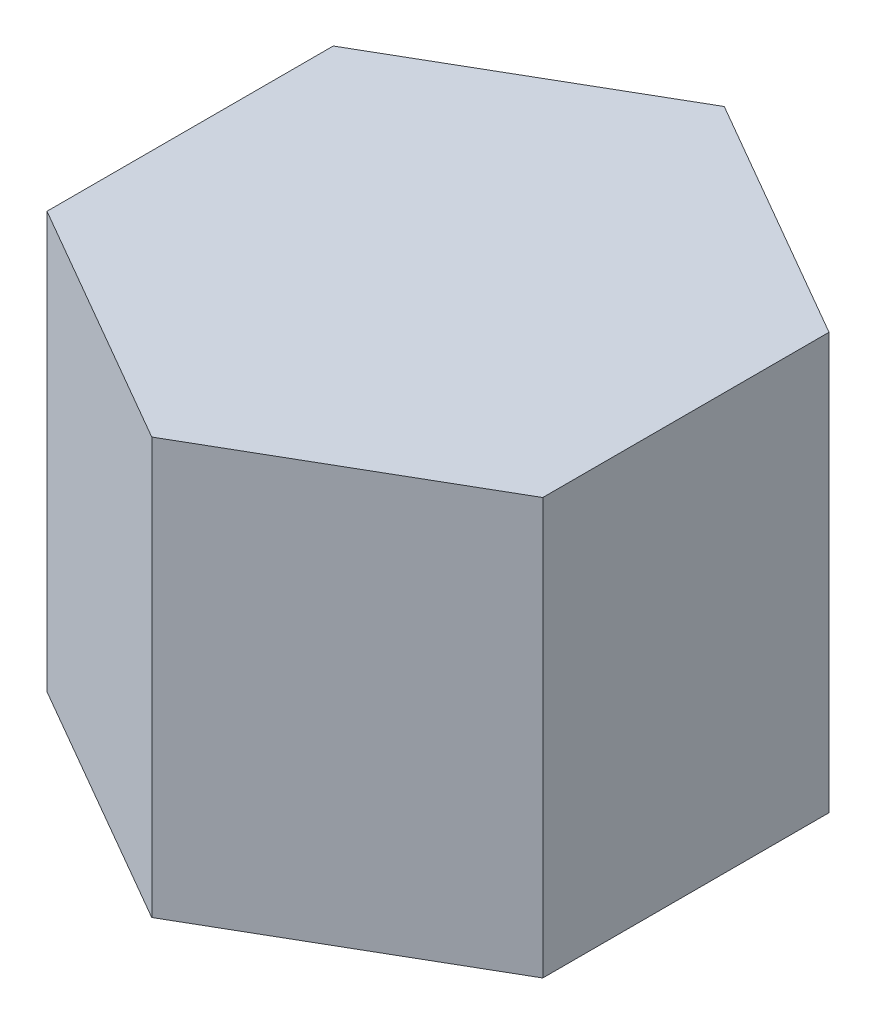
ISO-10303-21;
HEADER;
FILE_DESCRIPTION(('STEP AP214'),'2;1');
FILE_NAME('part.step','',(''),(''),'','','');
FILE_SCHEMA(('AUTOMOTIVE_DESIGN { 1 0 10303 214 1 1 1 1 }'));
ENDSEC;
DATA;
#1=APPLICATION_CONTEXT('core data for automotive mechanical design processes');
#2=APPLICATION_PROTOCOL_DEFINITION('international standard','automotive_design',2000,#1);
#3=PRODUCT_CONTEXT('',#1,'mechanical');
#4=PRODUCT('Part','Part','',(#3));
#5=PRODUCT_RELATED_PRODUCT_CATEGORY('part','',(#4));
#6=PRODUCT_DEFINITION_FORMATION('','',#4);
#7=PRODUCT_DEFINITION_CONTEXT('part definition',#1,'design');
#8=PRODUCT_DEFINITION('design','',#6,#7);
#9=PRODUCT_DEFINITION_SHAPE('','',#8);
#10=(LENGTH_UNIT() NAMED_UNIT(*) SI_UNIT(.MILLI.,.METRE.));
#11=(NAMED_UNIT(*) PLANE_ANGLE_UNIT() SI_UNIT($,.RADIAN.));
#12=(NAMED_UNIT(*) SI_UNIT($,.STERADIAN.) SOLID_ANGLE_UNIT());
#13=UNCERTAINTY_MEASURE_WITH_UNIT(LENGTH_MEASURE(1.E-05),#10,'distance_accuracy_value','');
#14=(GEOMETRIC_REPRESENTATION_CONTEXT(3) GLOBAL_UNCERTAINTY_ASSIGNED_CONTEXT((#13)) GLOBAL_UNIT_ASSIGNED_CONTEXT((#10,
#11,#12)) REPRESENTATION_CONTEXT('',''));
#15=CARTESIAN_POINT('',(0.,0.,0.));
#16=DIRECTION('',(0.,0.,1.));
#17=DIRECTION('',(1.,0.,0.));
#18=AXIS2_PLACEMENT_3D('',#15,#16,#17);
#19=CARTESIAN_POINT('',(203.339551417382,-147.556598747966,288.217869605357));
#20=DIRECTION('',(-0.499999999999943,0.,-0.866025403784471));
#21=DIRECTION('',(-0.866025403784471,0.,0.499999999999943));
#22=AXIS2_PLACEMENT_3D('',#19,#20,#21);
#23=PLANE('',#22);
#24=CARTESIAN_POINT('',(203.642660308706,-147.047793579175,288.042869605357));
#25=DIRECTION('',(-0.866025403784471,0.,0.499999999999943));
#26=VECTOR('',#25,1.);
#27=LINE('',#24,#26);
#28=CARTESIAN_POINT('',(203.642660308706,-147.047793579175,288.042869605357));
#29=VERTEX_POINT('',#28);
#30=CARTESIAN_POINT('',(203.339551417382,-147.047793579175,288.217869605357));
#31=VERTEX_POINT('',#30);
#32=EDGE_CURVE('E170',#29,#31,#27,.T.);
#33=ORIENTED_EDGE('',*,*,#32,.T.);
#34=CARTESIAN_POINT('',(203.339551417382,-147.556598747966,288.217869605357));
#35=DIRECTION('',(0.,1.,0.));
#36=VECTOR('',#35,1.);
#37=LINE('',#34,#36);
#38=CARTESIAN_POINT('',(203.339551417382,-147.556598747966,288.217869605357));
#39=VERTEX_POINT('',#38);
#40=EDGE_CURVE('E35',#39,#31,#37,.T.);
#41=ORIENTED_EDGE('',*,*,#40,.F.);
#42=CARTESIAN_POINT('',(203.642660308706,-147.556598747966,288.042869605357));
#43=DIRECTION('',(-0.866025403784471,0.,0.499999999999943));
#44=VECTOR('',#43,1.);
#45=LINE('',#42,#44);
#46=CARTESIAN_POINT('',(203.642660308706,-147.556598747966,288.042869605357));
#47=VERTEX_POINT('',#46);
#48=EDGE_CURVE('E159',#47,#39,#45,.T.);
#49=ORIENTED_EDGE('',*,*,#48,.F.);
#50=CARTESIAN_POINT('',(203.642660308706,-147.556598747966,288.042869605357));
#51=DIRECTION('',(0.,1.,0.));
#52=VECTOR('',#51,1.);
#53=LINE('',#50,#52);
#54=EDGE_CURVE('E10',#47,#29,#53,.T.);
#55=ORIENTED_EDGE('',*,*,#54,.T.);
#56=EDGE_LOOP('',(#33,#41,#49,#55));
#57=FACE_BOUND('',#56,.T.);
#58=ADVANCED_FACE('F16',(#57),#23,.F.);
#59=CARTESIAN_POINT('',(203.642660308706,-147.556598747966,291.594471220494));
#60=DIRECTION('',(-1.,0.,0.));
#61=DIRECTION('',(0.,-1.,0.));
#62=AXIS2_PLACEMENT_3D('',#59,#60,#61);
#63=PLANE('',#62);
#64=CARTESIAN_POINT('',(203.642660308706,-147.047793579175,287.692869605357));
#65=DIRECTION('',(0.,0.,1.));
#66=VECTOR('',#65,1.);
#67=LINE('',#64,#66);
#68=CARTESIAN_POINT('',(203.642660308706,-147.047793579175,287.692869605357));
#69=VERTEX_POINT('',#68);
#70=EDGE_CURVE('E167',#69,#29,#67,.T.);
#71=ORIENTED_EDGE('',*,*,#70,.T.);
#72=ORIENTED_EDGE('',*,*,#54,.F.);
#73=CARTESIAN_POINT('',(203.642660308706,-147.556598747966,287.692869605357));
#74=DIRECTION('',(0.,0.,1.));
#75=VECTOR('',#74,1.);
#76=LINE('',#73,#75);
#77=CARTESIAN_POINT('',(203.642660308706,-147.556598747966,287.692869605357));
#78=VERTEX_POINT('',#77);
#79=EDGE_CURVE('E156',#78,#47,#76,.T.);
#80=ORIENTED_EDGE('',*,*,#79,.F.);
#81=CARTESIAN_POINT('',(203.642660308706,-147.556598747966,287.692869605357));
#82=DIRECTION('',(0.,1.,0.));
#83=VECTOR('',#82,1.);
#84=LINE('',#81,#83);
#85=EDGE_CURVE('E27',#78,#69,#84,.T.);
#86=ORIENTED_EDGE('',*,*,#85,.T.);
#87=EDGE_LOOP('',(#71,#72,#80,#86));
#88=FACE_BOUND('',#87,.T.);
#89=ADVANCED_FACE('F189',(#88),#63,.F.);
#90=CARTESIAN_POINT('',(203.642660308706,-147.556598747966,287.692869605357));
#91=DIRECTION('',(-0.499999999999978,0.,0.866025403784452));
#92=DIRECTION('',(0.866025403784452,0.,0.499999999999978));
#93=AXIS2_PLACEMENT_3D('',#90,#91,#92);
#94=PLANE('',#93);
#95=CARTESIAN_POINT('',(203.339551417382,-147.047793579175,287.517869605357));
#96=DIRECTION('',(0.866025403784452,0.,0.499999999999978));
#97=VECTOR('',#96,1.);
#98=LINE('',#95,#97);
#99=CARTESIAN_POINT('',(203.339551417382,-147.047793579175,287.517869605357));
#100=VERTEX_POINT('',#99);
#101=EDGE_CURVE('E163',#100,#69,#98,.T.);
#102=ORIENTED_EDGE('',*,*,#101,.T.);
#103=ORIENTED_EDGE('',*,*,#85,.F.);
#104=CARTESIAN_POINT('',(203.339551417382,-147.556598747966,287.517869605357));
#105=DIRECTION('',(0.866025403784452,0.,0.499999999999978));
#106=VECTOR('',#105,1.);
#107=LINE('',#104,#106);
#108=CARTESIAN_POINT('',(203.339551417382,-147.556598747966,287.517869605357));
#109=VERTEX_POINT('',#108);
#110=EDGE_CURVE('E106',#109,#78,#107,.T.);
#111=ORIENTED_EDGE('',*,*,#110,.F.);
#112=CARTESIAN_POINT('',(203.339551417382,-147.556598747966,287.517869605357));
#113=DIRECTION('',(0.,1.,0.));
#114=VECTOR('',#113,1.);
#115=LINE('',#112,#114);
#116=EDGE_CURVE('E94',#109,#100,#115,.T.);
#117=ORIENTED_EDGE('',*,*,#116,.T.);
#118=EDGE_LOOP('',(#102,#103,#111,#117));
#119=FACE_BOUND('',#118,.T.);
#120=ADVANCED_FACE('F198',(#119),#94,.F.);
#121=CARTESIAN_POINT('',(203.339551417382,-147.556598747966,287.517869605357));
#122=DIRECTION('',(0.499999999999978,0.,0.866025403784452));
#123=DIRECTION('',(0.866025403784452,0.,-0.499999999999978));
#124=AXIS2_PLACEMENT_3D('',#121,#122,#123);
#125=PLANE('',#124);
#126=CARTESIAN_POINT('',(203.036442526057,-147.047793579175,287.692869605357));
#127=DIRECTION('',(0.866025403784452,0.,-0.499999999999978));
#128=VECTOR('',#127,1.);
#129=LINE('',#126,#128);
#130=CARTESIAN_POINT('',(203.036442526057,-147.047793579175,287.692869605357));
#131=VERTEX_POINT('',#130);
#132=EDGE_CURVE('E162',#131,#100,#129,.T.);
#133=ORIENTED_EDGE('',*,*,#132,.T.);
#134=ORIENTED_EDGE('',*,*,#116,.F.);
#135=CARTESIAN_POINT('',(203.036442526057,-147.556598747966,287.692869605357));
#136=DIRECTION('',(0.866025403784452,0.,-0.499999999999978));
#137=VECTOR('',#136,1.);
#138=LINE('',#135,#137);
#139=CARTESIAN_POINT('',(203.036442526057,-147.556598747966,287.692869605357));
#140=VERTEX_POINT('',#139);
#141=EDGE_CURVE('E98',#140,#109,#138,.T.);
#142=ORIENTED_EDGE('',*,*,#141,.F.);
#143=CARTESIAN_POINT('',(203.036442526057,-147.556598747966,287.692869605357));
#144=DIRECTION('',(0.,1.,0.));
#145=VECTOR('',#144,1.);
#146=LINE('',#143,#145);
#147=EDGE_CURVE('E79',#140,#131,#146,.T.);
#148=ORIENTED_EDGE('',*,*,#147,.T.);
#149=EDGE_LOOP('',(#133,#134,#142,#148));
#150=FACE_BOUND('',#149,.T.);
#151=ADVANCED_FACE('F100',(#150),#125,.F.);
#152=CARTESIAN_POINT('',(203.036442526057,-147.556598747966,291.594471220494));
#153=DIRECTION('',(1.,0.,0.));
#154=DIRECTION('',(0.,1.,0.));
#155=AXIS2_PLACEMENT_3D('',#152,#153,#154);
#156=PLANE('',#155);
#157=CARTESIAN_POINT('',(203.036442526057,-147.047793579175,288.042869605357));
#158=DIRECTION('',(0.,0.,-1.));
#159=VECTOR('',#158,1.);
#160=LINE('',#157,#159);
#161=CARTESIAN_POINT('',(203.036442526057,-147.047793579175,288.042869605357));
#162=VERTEX_POINT('',#161);
#163=EDGE_CURVE('E88',#162,#131,#160,.T.);
#164=ORIENTED_EDGE('',*,*,#163,.T.);
#165=ORIENTED_EDGE('',*,*,#147,.F.);
#166=CARTESIAN_POINT('',(203.036442526057,-147.556598747966,288.042869605357));
#167=DIRECTION('',(0.,0.,-1.));
#168=VECTOR('',#167,1.);
#169=LINE('',#166,#168);
#170=CARTESIAN_POINT('',(203.036442526057,-147.556598747966,288.042869605357));
#171=VERTEX_POINT('',#170);
#172=EDGE_CURVE('E84',#171,#140,#169,.T.);
#173=ORIENTED_EDGE('',*,*,#172,.F.);
#174=CARTESIAN_POINT('',(203.036442526057,-147.556598747966,288.042869605357));
#175=DIRECTION('',(0.,1.,0.));
#176=VECTOR('',#175,1.);
#177=LINE('',#174,#176);
#178=EDGE_CURVE('E58',#171,#162,#177,.T.);
#179=ORIENTED_EDGE('',*,*,#178,.T.);
#180=EDGE_LOOP('',(#164,#165,#173,#179));
#181=FACE_BOUND('',#180,.T.);
#182=ADVANCED_FACE('F82',(#181),#156,.F.);
#183=CARTESIAN_POINT('',(203.036442526057,-147.556598747966,288.042869605357));
#184=DIRECTION('',(0.499999999999943,0.,-0.866025403784471));
#185=DIRECTION('',(-0.866025403784471,0.,-0.499999999999943));
#186=AXIS2_PLACEMENT_3D('',#183,#184,#185);
#187=PLANE('',#186);
#188=CARTESIAN_POINT('',(203.339551417382,-147.047793579175,288.217869605357));
#189=DIRECTION('',(-0.866025403784471,0.,-0.499999999999943));
#190=VECTOR('',#189,1.);
#191=LINE('',#188,#190);
#192=EDGE_CURVE('E160',#31,#162,#191,.T.);
#193=ORIENTED_EDGE('',*,*,#192,.T.);
#194=ORIENTED_EDGE('',*,*,#178,.F.);
#195=CARTESIAN_POINT('',(203.339551417382,-147.556598747966,288.217869605357));
#196=DIRECTION('',(-0.866025403784471,0.,-0.499999999999943));
#197=VECTOR('',#196,1.);
#198=LINE('',#195,#197);
#199=EDGE_CURVE('E112',#39,#171,#198,.T.);
#200=ORIENTED_EDGE('',*,*,#199,.F.);
#201=ORIENTED_EDGE('',*,*,#40,.T.);
#202=EDGE_LOOP('',(#193,#194,#200,#201));
#203=FACE_BOUND('',#202,.T.);
#204=ADVANCED_FACE('F131',(#203),#187,.F.);
#205=CARTESIAN_POINT('',(206.491105863044,-147.556598747966,291.594471220494));
#206=DIRECTION('',(0.,1.,0.));
#207=DIRECTION('',(-1.,0.,0.));
#208=AXIS2_PLACEMENT_3D('',#205,#206,#207);
#209=PLANE('',#208);
#210=ORIENTED_EDGE('',*,*,#48,.T.);
#211=ORIENTED_EDGE('',*,*,#199,.T.);
#212=ORIENTED_EDGE('',*,*,#172,.T.);
#213=ORIENTED_EDGE('',*,*,#141,.T.);
#214=ORIENTED_EDGE('',*,*,#110,.T.);
#215=ORIENTED_EDGE('',*,*,#79,.T.);
#216=EDGE_LOOP('',(#210,#211,#212,#213,#214,#215));
#217=FACE_BOUND('',#216,.T.);
#218=ADVANCED_FACE('F111',(#217),#209,.F.);
#219=CARTESIAN_POINT('',(206.491105863044,-147.047793579175,291.594471220494));
#220=DIRECTION('',(0.,1.,0.));
#221=DIRECTION('',(-1.,0.,0.));
#222=AXIS2_PLACEMENT_3D('',#219,#220,#221);
#223=PLANE('',#222);
#224=ORIENTED_EDGE('',*,*,#32,.F.);
#225=ORIENTED_EDGE('',*,*,#70,.F.);
#226=ORIENTED_EDGE('',*,*,#101,.F.);
#227=ORIENTED_EDGE('',*,*,#132,.F.);
#228=ORIENTED_EDGE('',*,*,#163,.F.);
#229=ORIENTED_EDGE('',*,*,#192,.F.);
#230=EDGE_LOOP('',(#224,#225,#226,#227,#228,#229));
#231=FACE_BOUND('',#230,.T.);
#232=ADVANCED_FACE('F130',(#231),#223,.T.);
#233=CLOSED_SHELL('',(#58,#89,#120,#151,#182,#204,#218,#232));
#234=MANIFOLD_SOLID_BREP('B1',#233);
#235=ADVANCED_BREP_SHAPE_REPRESENTATION('',(#18,#234),#14);
#236=SHAPE_DEFINITION_REPRESENTATION(#9,#235);
ENDSEC;
END-ISO-10303-21;
